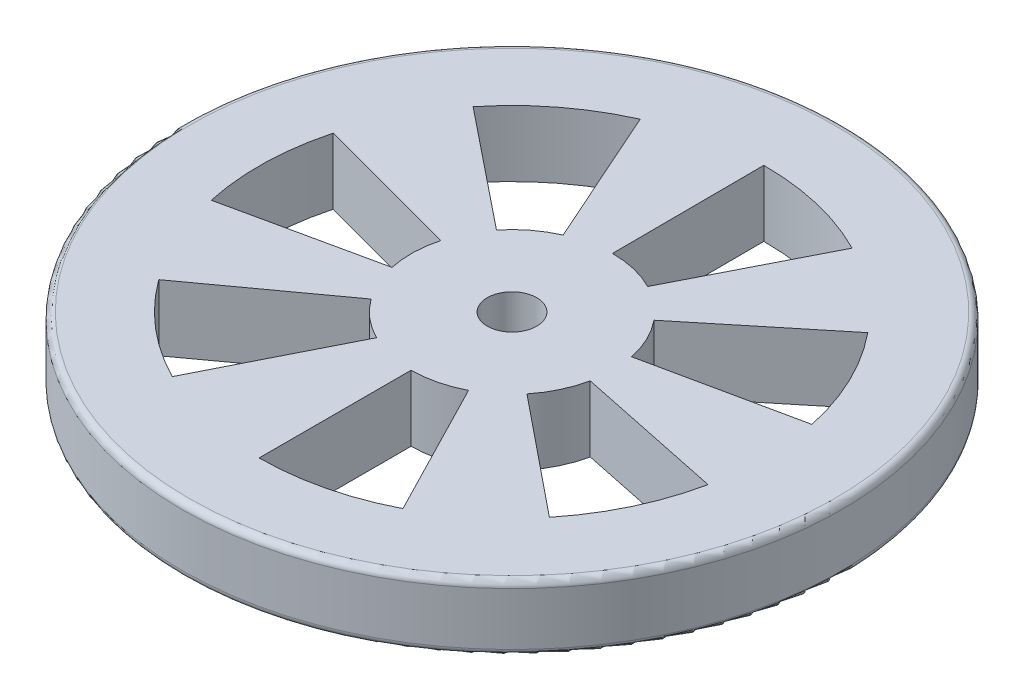
ISO-10303-21;
HEADER;
FILE_DESCRIPTION(('STEP AP214'),'2;1');
FILE_NAME('part.step','',(''),(''),'','','');
FILE_SCHEMA(('AUTOMOTIVE_DESIGN { 1 0 10303 214 1 1 1 1 }'));
ENDSEC;
DATA;
#1=APPLICATION_CONTEXT('core data for automotive mechanical design processes');
#2=APPLICATION_PROTOCOL_DEFINITION('international standard','automotive_design',2000,#1);
#3=PRODUCT_CONTEXT('',#1,'mechanical');
#4=PRODUCT('Part','Part','',(#3));
#5=PRODUCT_RELATED_PRODUCT_CATEGORY('part','',(#4));
#6=PRODUCT_DEFINITION_FORMATION('','',#4);
#7=PRODUCT_DEFINITION_CONTEXT('part definition',#1,'design');
#8=PRODUCT_DEFINITION('design','',#6,#7);
#9=PRODUCT_DEFINITION_SHAPE('','',#8);
#10=(LENGTH_UNIT() NAMED_UNIT(*) SI_UNIT(.MILLI.,.METRE.));
#11=(NAMED_UNIT(*) PLANE_ANGLE_UNIT() SI_UNIT($,.RADIAN.));
#12=(NAMED_UNIT(*) SI_UNIT($,.STERADIAN.) SOLID_ANGLE_UNIT());
#13=UNCERTAINTY_MEASURE_WITH_UNIT(LENGTH_MEASURE(1.E-05),#10,'distance_accuracy_value','');
#14=(GEOMETRIC_REPRESENTATION_CONTEXT(3) GLOBAL_UNCERTAINTY_ASSIGNED_CONTEXT((#13)) GLOBAL_UNIT_ASSIGNED_CONTEXT((#10,
#11,#12)) REPRESENTATION_CONTEXT('',''));
#15=CARTESIAN_POINT('',(0.,0.,0.));
#16=DIRECTION('',(0.,0.,1.));
#17=DIRECTION('',(1.,0.,0.));
#18=AXIS2_PLACEMENT_3D('',#15,#16,#17);
#19=CARTESIAN_POINT('',(0.,20.,0.));
#20=DIRECTION('',(0.,-1.,0.));
#21=DIRECTION('',(0.,0.,-1.));
#22=AXIS2_PLACEMENT_3D('',#19,#20,#21);
#23=CYLINDRICAL_SURFACE('',#22,100.);
#24=CARTESIAN_POINT('',(0.,2.,0.));
#25=DIRECTION('',(0.,1.,0.));
#26=DIRECTION('',(0.,0.,1.));
#27=AXIS2_PLACEMENT_3D('',#24,#25,#26);
#28=CIRCLE('',#27,100.);
#29=CARTESIAN_POINT('',(0.,2.,100.));
#30=VERTEX_POINT('',#29);
#31=EDGE_CURVE('E460',#30,#30,#28,.T.);
#32=ORIENTED_EDGE('',*,*,#31,.T.);
#33=EDGE_LOOP('',(#32));
#34=FACE_BOUND('',#33,.T.);
#35=CARTESIAN_POINT('',(0.,18.,0.));
#36=DIRECTION('',(0.,1.,0.));
#37=DIRECTION('',(0.,0.,1.));
#38=AXIS2_PLACEMENT_3D('',#35,#36,#37);
#39=CIRCLE('',#38,100.);
#40=CARTESIAN_POINT('',(0.,18.,100.));
#41=VERTEX_POINT('',#40);
#42=EDGE_CURVE('E455',#41,#41,#39,.F.);
#43=ORIENTED_EDGE('',*,*,#42,.T.);
#44=EDGE_LOOP('',(#43));
#45=FACE_BOUND('',#44,.T.);
#46=ADVANCED_FACE('F35',(#34,#45),#23,.T.);
#47=CARTESIAN_POINT('',(0.,20.,0.));
#48=DIRECTION('',(0.,1.,0.));
#49=DIRECTION('',(0.,0.,1.));
#50=AXIS2_PLACEMENT_3D('',#47,#48,#49);
#51=PLANE('',#50);
#52=CARTESIAN_POINT('',(0.,20.,0.));
#53=DIRECTION('',(0.,1.,0.));
#54=DIRECTION('',(0.80901699437494,0.,-0.587785252292483));
#55=AXIS2_PLACEMENT_3D('',#52,#53,#54);
#56=CIRCLE('',#55,30.617728898153);
#57=CARTESIAN_POINT('',(-24.7702630077705,20.,17.9966495050237));
#58=VERTEX_POINT('',#57);
#59=CARTESIAN_POINT('',(-13.7823703581596,20.,27.3402924306108));
#60=VERTEX_POINT('',#59);
#61=EDGE_CURVE('E359',#58,#60,#56,.T.);
#62=ORIENTED_EDGE('',*,*,#61,.T.);
#63=DIRECTION('',(-0.450143457864081,0.,0.892956251639557));
#64=VECTOR('',#63,1.);
#65=CARTESIAN_POINT('',(-13.7823703581596,20.,27.3402924306108));
#66=LINE('',#65,#64);
#67=CARTESIAN_POINT('',(-34.5404654667507,20.,68.5184334776853));
#68=VERTEX_POINT('',#67);
#69=EDGE_CURVE('E362',#60,#68,#66,.T.);
#70=ORIENTED_EDGE('',*,*,#69,.T.);
#71=CARTESIAN_POINT('',(0.,20.,0.));
#72=DIRECTION('',(0.,-1.,0.));
#73=DIRECTION('',(0.80901699437494,0.,-0.587785252292483));
#74=AXIS2_PLACEMENT_3D('',#71,#72,#73);
#75=CIRCLE('',#74,76.7321280878862);
#76=CARTESIAN_POINT('',(-62.0775956376546,20.,45.1020132670773));
#77=VERTEX_POINT('',#76);
#78=EDGE_CURVE('E50',#68,#77,#75,.T.);
#79=ORIENTED_EDGE('',*,*,#78,.T.);
#80=DIRECTION('',(0.80901699437494,0.,-0.587785252292483));
#81=VECTOR('',#80,1.);
#82=CARTESIAN_POINT('',(-24.7702630077705,20.,17.9966495050237));
#83=LINE('',#82,#81);
#84=EDGE_CURVE('E367',#77,#58,#83,.T.);
#85=ORIENTED_EDGE('',*,*,#84,.T.);
#86=EDGE_LOOP('',(#62,#70,#79,#85));
#87=FACE_BOUND('',#86,.T.);
#88=CARTESIAN_POINT('',(0.,20.,0.));
#89=DIRECTION('',(0.,1.,0.));
#90=DIRECTION('',(0.406736643075808,0.,0.913545457642598));
#91=AXIS2_PLACEMENT_3D('',#88,#89,#90);
#92=CIRCLE('',#91,30.617728898153);
#93=CARTESIAN_POINT('',(-12.4533522706399,20.,-27.9706871582401));
#94=VERTEX_POINT('',#93);
#95=CARTESIAN_POINT('',(-23.877325519721,20.,-19.1655589249589));
#96=VERTEX_POINT('',#95);
#97=EDGE_CURVE('E331',#94,#96,#92,.T.);
#98=ORIENTED_EDGE('',*,*,#97,.T.);
#99=DIRECTION('',(-0.779852927666409,0.,-0.625962787400442));
#100=VECTOR('',#99,1.);
#101=CARTESIAN_POINT('',(-23.877325519721,20.,-19.1655589249589));
#102=LINE('',#101,#100);
#103=CARTESIAN_POINT('',(-59.839774735412,20.,-48.031456781061));
#104=VERTEX_POINT('',#103);
#105=EDGE_CURVE('E334',#96,#104,#102,.T.);
#106=ORIENTED_EDGE('',*,*,#105,.T.);
#107=CARTESIAN_POINT('',(0.,20.,0.));
#108=DIRECTION('',(0.,-1.,0.));
#109=DIRECTION('',(0.406736643075808,0.,0.913545457642598));
#110=AXIS2_PLACEMENT_3D('',#107,#108,#109);
#111=CIRCLE('',#110,76.7321280878862);
#112=CARTESIAN_POINT('',(-31.2097681945297,20.,-70.0982870699384));
#113=VERTEX_POINT('',#112);
#114=EDGE_CURVE('E58',#104,#113,#111,.T.);
#115=ORIENTED_EDGE('',*,*,#114,.T.);
#116=DIRECTION('',(0.406736643075807,0.,0.913545457642598));
#117=VECTOR('',#116,1.);
#118=CARTESIAN_POINT('',(-12.4533522706399,20.,-27.9706871582401));
#119=LINE('',#118,#117);
#120=EDGE_CURVE('E339',#113,#94,#119,.T.);
#121=ORIENTED_EDGE('',*,*,#120,.T.);
#122=EDGE_LOOP('',(#98,#106,#115,#121));
#123=FACE_BOUND('',#122,.T.);
#124=CARTESIAN_POINT('',(0.,20.,0.));
#125=DIRECTION('',(0.,1.,0.));
#126=DIRECTION('',(0.965925826289071,0.,0.258819045102511));
#127=AXIS2_PLACEMENT_3D('',#124,#125,#126);
#128=CIRCLE('',#127,30.617728898153);
#129=CARTESIAN_POINT('',(-29.5744550850432,20.,-7.92445135662751));
#130=VERTEX_POINT('',#129);
#131=CARTESIAN_POINT('',(-29.9209245508925,20.,6.49489006070088));
#132=VERTEX_POINT('',#131);
#133=EDGE_CURVE('E297',#130,#132,#128,.T.);
#134=ORIENTED_EDGE('',*,*,#133,.T.);
#135=DIRECTION('',(-0.977241801650986,0.,0.212128407116855));
#136=VECTOR('',#135,1.);
#137=CARTESIAN_POINT('',(-29.9209245508925,20.,6.49489006070088));
#138=LINE('',#137,#136);
#139=CARTESIAN_POINT('',(-74.9858430971202,20.,16.2770641059698));
#140=VERTEX_POINT('',#139);
#141=EDGE_CURVE('E300',#132,#140,#138,.T.);
#142=ORIENTED_EDGE('',*,*,#141,.T.);
#143=CARTESIAN_POINT('',(0.,20.,0.));
#144=DIRECTION('',(0.,-1.,0.));
#145=DIRECTION('',(0.965925826289071,0.,0.258819045102511));
#146=AXIS2_PLACEMENT_3D('',#143,#144,#145);
#147=CIRCLE('',#146,76.7321280878862);
#148=CARTESIAN_POINT('',(-74.1175442262103,20.,-19.8597361203903));
#149=VERTEX_POINT('',#148);
#150=EDGE_CURVE('E304',#140,#149,#147,.T.);
#151=ORIENTED_EDGE('',*,*,#150,.T.);
#152=DIRECTION('',(0.965925826289071,0.,0.258819045102511));
#153=VECTOR('',#152,1.);
#154=CARTESIAN_POINT('',(-29.5744550850432,20.,-7.92445135662751));
#155=LINE('',#154,#153);
#156=EDGE_CURVE('E307',#149,#130,#155,.T.);
#157=ORIENTED_EDGE('',*,*,#156,.T.);
#158=EDGE_LOOP('',(#134,#142,#151,#157));
#159=FACE_BOUND('',#158,.T.);
#160=CARTESIAN_POINT('',(0.,20.,0.));
#161=DIRECTION('',(0.,1.,0.));
#162=DIRECTION('',(-0.978147600733805,0.,0.207911690817763));
#163=AXIS2_PLACEMENT_3D('',#160,#161,#162);
#164=CIRCLE('',#163,30.617728898153);
#165=CARTESIAN_POINT('',(29.9486580616464,20.,-6.36578378421487));
#166=VERTEX_POINT('',#165);
#167=CARTESIAN_POINT('',(23.7111206001822,20.,-19.3708049074995));
#168=VERTEX_POINT('',#167);
#169=EDGE_CURVE('E265',#166,#168,#164,.T.);
#170=ORIENTED_EDGE('',*,*,#169,.T.);
#171=DIRECTION('',(0.774424539424693,0.,-0.632666288604706));
#172=VECTOR('',#171,1.);
#173=CARTESIAN_POINT('',(23.7111206001822,20.,-19.3708049074995));
#174=LINE('',#173,#172);
#175=CARTESIAN_POINT('',(59.4232429535378,20.,-48.5458306941039));
#176=VERTEX_POINT('',#175);
#177=EDGE_CURVE('E268',#168,#176,#174,.T.);
#178=ORIENTED_EDGE('',*,*,#177,.T.);
#179=CARTESIAN_POINT('',(0.,20.,0.));
#180=DIRECTION('',(0.,-1.,0.));
#181=DIRECTION('',(-0.978147600733805,0.,0.207911690817763));
#182=AXIS2_PLACEMENT_3D('',#179,#180,#181);
#183=CIRCLE('',#182,76.7321280878862);
#184=CARTESIAN_POINT('',(75.0553469883649,20.,-15.9535064907976));
#185=VERTEX_POINT('',#184);
#186=EDGE_CURVE('E272',#176,#185,#183,.T.);
#187=ORIENTED_EDGE('',*,*,#186,.T.);
#188=DIRECTION('',(-0.978147600733805,0.,0.207911690817763));
#189=VECTOR('',#188,1.);
#190=CARTESIAN_POINT('',(29.9486580616464,20.,-6.36578378421487));
#191=LINE('',#190,#189);
#192=EDGE_CURVE('E275',#185,#166,#191,.T.);
#193=ORIENTED_EDGE('',*,*,#192,.T.);
#194=EDGE_LOOP('',(#170,#178,#187,#193));
#195=FACE_BOUND('',#194,.T.);
#196=CARTESIAN_POINT('',(0.,20.,0.));
#197=DIRECTION('',(0.,1.,0.));
#198=DIRECTION('',(-0.453990499739541,0.,0.891006524188371));
#199=AXIS2_PLACEMENT_3D('',#196,#197,#198);
#200=CIRCLE('',#199,30.617728898153);
#201=CARTESIAN_POINT('',(13.9001580433623,20.,-27.2805962040851));
#202=VERTEX_POINT('',#201);
#203=CARTESIAN_POINT('',(-0.132051115697628,20.,-30.6174441353885));
#204=VERTEX_POINT('',#203);
#205=EDGE_CURVE('E224',#202,#204,#200,.T.);
#206=ORIENTED_EDGE('',*,*,#205,.T.);
#207=DIRECTION('',(-0.00431289714978161,0.,-0.999990699415837));
#208=VECTOR('',#207,1.);
#209=CARTESIAN_POINT('',(-0.132051115697628,20.,-30.6174441353885));
#210=LINE('',#209,#208);
#211=CARTESIAN_POINT('',(-0.33093777652692,20.,-76.731414434271));
#212=VERTEX_POINT('',#211);
#213=EDGE_CURVE('E236',#204,#212,#210,.T.);
#214=ORIENTED_EDGE('',*,*,#213,.T.);
#215=CARTESIAN_POINT('',(0.,20.,0.));
#216=DIRECTION('',(0.,-1.,0.));
#217=DIRECTION('',(-0.453990499739541,0.,0.891006524188371));
#218=AXIS2_PLACEMENT_3D('',#215,#216,#217);
#219=CIRCLE('',#218,76.7321280878862);
#220=CARTESIAN_POINT('',(34.835657176698,20.,-68.3688267411643));
#221=VERTEX_POINT('',#220);
#222=EDGE_CURVE('E240',#212,#221,#219,.T.);
#223=ORIENTED_EDGE('',*,*,#222,.T.);
#224=DIRECTION('',(-0.453990499739541,0.,0.891006524188371));
#225=VECTOR('',#224,1.);
#226=CARTESIAN_POINT('',(13.9001580433623,20.,-27.2805962040851));
#227=LINE('',#226,#225);
#228=EDGE_CURVE('E232',#221,#202,#227,.T.);
#229=ORIENTED_EDGE('',*,*,#228,.T.);
#230=EDGE_LOOP('',(#206,#214,#223,#229));
#231=FACE_BOUND('',#230,.T.);
#232=CARTESIAN_POINT('',(0.,20.,0.));
#233=DIRECTION('',(0.,1.,0.));
#234=DIRECTION('',(-0.777145961456972,0.,-0.629320391049836));
#235=AXIS2_PLACEMENT_3D('',#232,#233,#234);
#236=CIRCLE('',#235,30.617728898153);
#237=CARTESIAN_POINT('',(23.794444362184,20.,19.2683611232435));
#238=VERTEX_POINT('',#237);
#239=CARTESIAN_POINT('',(29.9758344923706,20.,6.23655909671318));
#240=VERTEX_POINT('',#239);
#241=EDGE_CURVE('E388',#238,#240,#236,.T.);
#242=ORIENTED_EDGE('',*,*,#241,.T.);
#243=DIRECTION('',(0.979035205128455,0.,0.203691107118314));
#244=VECTOR('',#243,1.);
#245=CARTESIAN_POINT('',(29.9758344923706,20.,6.23655909671318));
#246=LINE('',#245,#244);
#247=CARTESIAN_POINT('',(75.1234547624665,20.,15.6296521217658));
#248=VERTEX_POINT('',#247);
#249=EDGE_CURVE('E391',#240,#248,#246,.T.);
#250=ORIENTED_EDGE('',*,*,#249,.T.);
#251=CARTESIAN_POINT('',(0.,20.,0.));
#252=DIRECTION('',(0.,-1.,0.));
#253=DIRECTION('',(-0.777145961456972,0.,-0.629320391049836));
#254=AXIS2_PLACEMENT_3D('',#251,#252,#253);
#255=CIRCLE('',#254,76.7321280878862);
#256=CARTESIAN_POINT('',(59.6320634574999,20.,48.2890928543546));
#257=VERTEX_POINT('',#256);
#258=EDGE_CURVE('E395',#248,#257,#255,.T.);
#259=ORIENTED_EDGE('',*,*,#258,.T.);
#260=DIRECTION('',(-0.777145961456972,0.,-0.629320391049836));
#261=VECTOR('',#260,1.);
#262=CARTESIAN_POINT('',(23.794444362184,20.,19.2683611232435));
#263=LINE('',#262,#261);
#264=EDGE_CURVE('E398',#257,#238,#263,.T.);
#265=ORIENTED_EDGE('',*,*,#264,.T.);
#266=EDGE_LOOP('',(#242,#250,#259,#265));
#267=FACE_BOUND('',#266,.T.);
#268=CARTESIAN_POINT('',(0.,20.,0.));
#269=DIRECTION('',(0.,1.,0.));
#270=DIRECTION('',(0.,0.,-1.));
#271=AXIS2_PLACEMENT_3D('',#268,#269,#270);
#272=CIRCLE('',#271,30.617728898153);
#273=CARTESIAN_POINT('',(0.,20.,30.617728898153));
#274=VERTEX_POINT('',#273);
#275=CARTESIAN_POINT('',(14.0176871693854,20.,27.2203925265974));
#276=VERTEX_POINT('',#275);
#277=EDGE_CURVE('E420',#274,#276,#272,.T.);
#278=ORIENTED_EDGE('',*,*,#277,.T.);
#279=DIRECTION('',(0.457829096861298,0.,0.889040222974848));
#280=VECTOR('',#279,1.);
#281=CARTESIAN_POINT('',(14.0176871693854,20.,27.2203925265974));
#282=LINE('',#281,#280);
#283=CARTESIAN_POINT('',(35.1302009027224,20.,68.217948264589));
#284=VERTEX_POINT('',#283);
#285=EDGE_CURVE('E423',#276,#284,#282,.T.);
#286=ORIENTED_EDGE('',*,*,#285,.T.);
#287=CARTESIAN_POINT('',(0.,20.,0.));
#288=DIRECTION('',(0.,-1.,0.));
#289=DIRECTION('',(0.,0.,-1.));
#290=AXIS2_PLACEMENT_3D('',#287,#288,#289);
#291=CIRCLE('',#290,76.7321280878862);
#292=CARTESIAN_POINT('',(0.,20.,76.7321280878862));
#293=VERTEX_POINT('',#292);
#294=EDGE_CURVE('E427',#284,#293,#291,.T.);
#295=ORIENTED_EDGE('',*,*,#294,.T.);
#296=DIRECTION('',(0.,0.,-1.));
#297=VECTOR('',#296,1.);
#298=CARTESIAN_POINT('',(0.,20.,30.617728898153));
#299=LINE('',#298,#297);
#300=EDGE_CURVE('E430',#293,#274,#299,.T.);
#301=ORIENTED_EDGE('',*,*,#300,.T.);
#302=EDGE_LOOP('',(#278,#286,#295,#301));
#303=FACE_BOUND('',#302,.T.);
#304=CARTESIAN_POINT('',(0.,20.,0.));
#305=DIRECTION('',(0.,1.,0.));
#306=DIRECTION('',(0.,0.,1.));
#307=AXIS2_PLACEMENT_3D('',#304,#305,#306);
#308=CIRCLE('',#307,7.5);
#309=CARTESIAN_POINT('',(0.,20.,7.5));
#310=VERTEX_POINT('',#309);
#311=EDGE_CURVE('E445',#310,#310,#308,.T.);
#312=ORIENTED_EDGE('',*,*,#311,.F.);
#313=EDGE_LOOP('',(#312));
#314=FACE_BOUND('',#313,.T.);
#315=CARTESIAN_POINT('',(0.,20.,0.));
#316=DIRECTION('',(0.,1.,0.));
#317=DIRECTION('',(0.,0.,1.));
#318=AXIS2_PLACEMENT_3D('',#315,#316,#317);
#319=CIRCLE('',#318,98.);
#320=CARTESIAN_POINT('',(0.,20.,98.));
#321=VERTEX_POINT('',#320);
#322=EDGE_CURVE('E11',#321,#321,#319,.T.);
#323=ORIENTED_EDGE('',*,*,#322,.T.);
#324=EDGE_LOOP('',(#323));
#325=FACE_BOUND('',#324,.T.);
#326=ADVANCED_FACE('F242',(#87,#123,#159,#195,#231,#267,#303,#314,#325),#51,.T.);
#327=CARTESIAN_POINT('',(0.,0.,0.));
#328=DIRECTION('',(0.,1.,0.));
#329=DIRECTION('',(0.,0.,1.));
#330=AXIS2_PLACEMENT_3D('',#327,#328,#329);
#331=PLANE('',#330);
#332=DIRECTION('',(-0.450143457864081,0.,0.892956251639557));
#333=VECTOR('',#332,1.);
#334=CARTESIAN_POINT('',(-13.7823703581596,0.,27.3402924306108));
#335=LINE('',#334,#333);
#336=CARTESIAN_POINT('',(-13.7823703581596,0.,27.3402924306108));
#337=VERTEX_POINT('',#336);
#338=CARTESIAN_POINT('',(-34.5404654667506,0.,68.5184334776853));
#339=VERTEX_POINT('',#338);
#340=EDGE_CURVE('E373',#337,#339,#335,.T.);
#341=ORIENTED_EDGE('',*,*,#340,.F.);
#342=CARTESIAN_POINT('',(0.,0.,0.));
#343=DIRECTION('',(0.,1.,0.));
#344=DIRECTION('',(0.80901699437494,0.,-0.587785252292483));
#345=AXIS2_PLACEMENT_3D('',#342,#343,#344);
#346=CIRCLE('',#345,30.617728898153);
#347=CARTESIAN_POINT('',(-24.7702630077705,0.,17.9966495050237));
#348=VERTEX_POINT('',#347);
#349=EDGE_CURVE('E371',#348,#337,#346,.T.);
#350=ORIENTED_EDGE('',*,*,#349,.F.);
#351=DIRECTION('',(0.80901699437494,0.,-0.587785252292483));
#352=VECTOR('',#351,1.);
#353=CARTESIAN_POINT('',(-24.7702630077705,0.,17.9966495050237));
#354=LINE('',#353,#352);
#355=CARTESIAN_POINT('',(-62.0775956376546,0.,45.1020132670773));
#356=VERTEX_POINT('',#355);
#357=EDGE_CURVE('E363',#356,#348,#354,.T.);
#358=ORIENTED_EDGE('',*,*,#357,.F.);
#359=CARTESIAN_POINT('',(0.,0.,0.));
#360=DIRECTION('',(0.,-1.,0.));
#361=DIRECTION('',(0.80901699437494,0.,-0.587785252292483));
#362=AXIS2_PLACEMENT_3D('',#359,#360,#361);
#363=CIRCLE('',#362,76.7321280878862);
#364=EDGE_CURVE('E376',#339,#356,#363,.T.);
#365=ORIENTED_EDGE('',*,*,#364,.F.);
#366=EDGE_LOOP('',(#341,#350,#358,#365));
#367=FACE_BOUND('',#366,.T.);
#368=DIRECTION('',(-0.779852927666409,0.,-0.625962787400442));
#369=VECTOR('',#368,1.);
#370=CARTESIAN_POINT('',(-23.877325519721,0.,-19.1655589249589));
#371=LINE('',#370,#369);
#372=CARTESIAN_POINT('',(-23.877325519721,0.,-19.1655589249589));
#373=VERTEX_POINT('',#372);
#374=CARTESIAN_POINT('',(-59.839774735412,0.,-48.031456781061));
#375=VERTEX_POINT('',#374);
#376=EDGE_CURVE('E344',#373,#375,#371,.T.);
#377=ORIENTED_EDGE('',*,*,#376,.F.);
#378=CARTESIAN_POINT('',(0.,0.,0.));
#379=DIRECTION('',(0.,1.,0.));
#380=DIRECTION('',(0.406736643075808,0.,0.913545457642598));
#381=AXIS2_PLACEMENT_3D('',#378,#379,#380);
#382=CIRCLE('',#381,30.617728898153);
#383=CARTESIAN_POINT('',(-12.4533522706399,0.,-27.9706871582401));
#384=VERTEX_POINT('',#383);
#385=EDGE_CURVE('E324',#384,#373,#382,.T.);
#386=ORIENTED_EDGE('',*,*,#385,.F.);
#387=DIRECTION('',(0.406736643075807,0.,0.913545457642598));
#388=VECTOR('',#387,1.);
#389=CARTESIAN_POINT('',(-12.4533522706399,0.,-27.9706871582401));
#390=LINE('',#389,#388);
#391=CARTESIAN_POINT('',(-31.2097681945297,0.,-70.0982870699384));
#392=VERTEX_POINT('',#391);
#393=EDGE_CURVE('E335',#392,#384,#390,.T.);
#394=ORIENTED_EDGE('',*,*,#393,.F.);
#395=CARTESIAN_POINT('',(0.,0.,0.));
#396=DIRECTION('',(0.,-1.,0.));
#397=DIRECTION('',(0.406736643075808,0.,0.913545457642598));
#398=AXIS2_PLACEMENT_3D('',#395,#396,#397);
#399=CIRCLE('',#398,76.7321280878862);
#400=EDGE_CURVE('E347',#375,#392,#399,.T.);
#401=ORIENTED_EDGE('',*,*,#400,.F.);
#402=EDGE_LOOP('',(#377,#386,#394,#401));
#403=FACE_BOUND('',#402,.T.);
#404=DIRECTION('',(-0.977241801650986,0.,0.212128407116855));
#405=VECTOR('',#404,1.);
#406=CARTESIAN_POINT('',(-29.9209245508925,0.,6.49489006070088));
#407=LINE('',#406,#405);
#408=CARTESIAN_POINT('',(-29.9209245508925,0.,6.49489006070088));
#409=VERTEX_POINT('',#408);
#410=CARTESIAN_POINT('',(-74.9858430971202,0.,16.2770641059698));
#411=VERTEX_POINT('',#410);
#412=EDGE_CURVE('E313',#409,#411,#407,.T.);
#413=ORIENTED_EDGE('',*,*,#412,.F.);
#414=CARTESIAN_POINT('',(0.,0.,0.));
#415=DIRECTION('',(0.,1.,0.));
#416=DIRECTION('',(0.965925826289071,0.,0.258819045102511));
#417=AXIS2_PLACEMENT_3D('',#414,#415,#416);
#418=CIRCLE('',#417,30.617728898153);
#419=CARTESIAN_POINT('',(-29.5744550850432,0.,-7.92445135662751));
#420=VERTEX_POINT('',#419);
#421=EDGE_CURVE('E311',#420,#409,#418,.T.);
#422=ORIENTED_EDGE('',*,*,#421,.F.);
#423=DIRECTION('',(0.965925826289071,0.,0.258819045102511));
#424=VECTOR('',#423,1.);
#425=CARTESIAN_POINT('',(-29.5744550850432,0.,-7.92445135662751));
#426=LINE('',#425,#424);
#427=CARTESIAN_POINT('',(-74.1175442262103,0.,-19.8597361203903));
#428=VERTEX_POINT('',#427);
#429=EDGE_CURVE('E301',#428,#420,#426,.T.);
#430=ORIENTED_EDGE('',*,*,#429,.F.);
#431=CARTESIAN_POINT('',(0.,0.,0.));
#432=DIRECTION('',(0.,-1.,0.));
#433=DIRECTION('',(0.965925826289071,0.,0.258819045102511));
#434=AXIS2_PLACEMENT_3D('',#431,#432,#433);
#435=CIRCLE('',#434,76.7321280878862);
#436=EDGE_CURVE('E317',#411,#428,#435,.T.);
#437=ORIENTED_EDGE('',*,*,#436,.F.);
#438=EDGE_LOOP('',(#413,#422,#430,#437));
#439=FACE_BOUND('',#438,.T.);
#440=DIRECTION('',(0.774424539424693,0.,-0.632666288604706));
#441=VECTOR('',#440,1.);
#442=CARTESIAN_POINT('',(23.7111206001822,0.,-19.3708049074995));
#443=LINE('',#442,#441);
#444=CARTESIAN_POINT('',(23.7111206001822,0.,-19.3708049074995));
#445=VERTEX_POINT('',#444);
#446=CARTESIAN_POINT('',(59.4232429535378,0.,-48.5458306941038));
#447=VERTEX_POINT('',#446);
#448=EDGE_CURVE('E280',#445,#447,#443,.T.);
#449=ORIENTED_EDGE('',*,*,#448,.F.);
#450=CARTESIAN_POINT('',(0.,0.,0.));
#451=DIRECTION('',(0.,1.,0.));
#452=DIRECTION('',(-0.978147600733805,0.,0.207911690817763));
#453=AXIS2_PLACEMENT_3D('',#450,#451,#452);
#454=CIRCLE('',#453,30.617728898153);
#455=CARTESIAN_POINT('',(29.9486580616464,0.,-6.36578378421487));
#456=VERTEX_POINT('',#455);
#457=EDGE_CURVE('E261',#456,#445,#454,.T.);
#458=ORIENTED_EDGE('',*,*,#457,.F.);
#459=DIRECTION('',(-0.978147600733805,0.,0.207911690817763));
#460=VECTOR('',#459,1.);
#461=CARTESIAN_POINT('',(29.9486580616464,0.,-6.36578378421487));
#462=LINE('',#461,#460);
#463=CARTESIAN_POINT('',(75.0553469883649,0.,-15.9535064907976));
#464=VERTEX_POINT('',#463);
#465=EDGE_CURVE('E269',#464,#456,#462,.T.);
#466=ORIENTED_EDGE('',*,*,#465,.F.);
#467=CARTESIAN_POINT('',(0.,0.,0.));
#468=DIRECTION('',(0.,-1.,0.));
#469=DIRECTION('',(-0.978147600733805,0.,0.207911690817763));
#470=AXIS2_PLACEMENT_3D('',#467,#468,#469);
#471=CIRCLE('',#470,76.7321280878862);
#472=EDGE_CURVE('E283',#447,#464,#471,.T.);
#473=ORIENTED_EDGE('',*,*,#472,.F.);
#474=EDGE_LOOP('',(#449,#458,#466,#473));
#475=FACE_BOUND('',#474,.T.);
#476=DIRECTION('',(-0.00431289714978161,0.,-0.999990699415837));
#477=VECTOR('',#476,1.);
#478=CARTESIAN_POINT('',(-0.132051115697628,0.,-30.6174441353885));
#479=LINE('',#478,#477);
#480=CARTESIAN_POINT('',(-0.132051115697628,0.,-30.6174441353885));
#481=VERTEX_POINT('',#480);
#482=CARTESIAN_POINT('',(-0.330937776526916,0.,-76.7314144342709));
#483=VERTEX_POINT('',#482);
#484=EDGE_CURVE('E254',#481,#483,#479,.T.);
#485=ORIENTED_EDGE('',*,*,#484,.F.);
#486=CARTESIAN_POINT('',(0.,0.,0.));
#487=DIRECTION('',(0.,1.,0.));
#488=DIRECTION('',(-0.453990499739541,0.,0.891006524188371));
#489=AXIS2_PLACEMENT_3D('',#486,#487,#488);
#490=CIRCLE('',#489,30.617728898153);
#491=CARTESIAN_POINT('',(13.9001580433623,0.,-27.2805962040851));
#492=VERTEX_POINT('',#491);
#493=EDGE_CURVE('E227',#492,#481,#490,.T.);
#494=ORIENTED_EDGE('',*,*,#493,.F.);
#495=DIRECTION('',(-0.453990499739541,0.,0.891006524188371));
#496=VECTOR('',#495,1.);
#497=CARTESIAN_POINT('',(13.9001580433623,0.,-27.2805962040851));
#498=LINE('',#497,#496);
#499=CARTESIAN_POINT('',(34.835657176698,0.,-68.3688267411643));
#500=VERTEX_POINT('',#499);
#501=EDGE_CURVE('E245',#500,#492,#498,.T.);
#502=ORIENTED_EDGE('',*,*,#501,.F.);
#503=CARTESIAN_POINT('',(0.,0.,0.));
#504=DIRECTION('',(0.,-1.,0.));
#505=DIRECTION('',(-0.453990499739541,0.,0.891006524188371));
#506=AXIS2_PLACEMENT_3D('',#503,#504,#505);
#507=CIRCLE('',#506,76.7321280878862);
#508=EDGE_CURVE('E248',#483,#500,#507,.T.);
#509=ORIENTED_EDGE('',*,*,#508,.F.);
#510=EDGE_LOOP('',(#485,#494,#502,#509));
#511=FACE_BOUND('',#510,.T.);
#512=DIRECTION('',(0.979035205128455,0.,0.203691107118314));
#513=VECTOR('',#512,1.);
#514=CARTESIAN_POINT('',(29.9758344923706,0.,6.23655909671318));
#515=LINE('',#514,#513);
#516=CARTESIAN_POINT('',(29.9758344923706,0.,6.23655909671318));
#517=VERTEX_POINT('',#516);
#518=CARTESIAN_POINT('',(75.1234547624665,0.,15.6296521217658));
#519=VERTEX_POINT('',#518);
#520=EDGE_CURVE('E403',#517,#519,#515,.T.);
#521=ORIENTED_EDGE('',*,*,#520,.F.);
#522=CARTESIAN_POINT('',(0.,0.,0.));
#523=DIRECTION('',(0.,1.,0.));
#524=DIRECTION('',(-0.777145961456972,0.,-0.629320391049836));
#525=AXIS2_PLACEMENT_3D('',#522,#523,#524);
#526=CIRCLE('',#525,30.617728898153);
#527=CARTESIAN_POINT('',(23.794444362184,0.,19.2683611232435));
#528=VERTEX_POINT('',#527);
#529=EDGE_CURVE('E290',#528,#517,#526,.T.);
#530=ORIENTED_EDGE('',*,*,#529,.F.);
#531=DIRECTION('',(-0.777145961456972,0.,-0.629320391049836));
#532=VECTOR('',#531,1.);
#533=CARTESIAN_POINT('',(23.794444362184,0.,19.2683611232435));
#534=LINE('',#533,#532);
#535=CARTESIAN_POINT('',(59.6320634574999,0.,48.2890928543546));
#536=VERTEX_POINT('',#535);
#537=EDGE_CURVE('E392',#536,#528,#534,.T.);
#538=ORIENTED_EDGE('',*,*,#537,.F.);
#539=CARTESIAN_POINT('',(0.,0.,0.));
#540=DIRECTION('',(0.,-1.,0.));
#541=DIRECTION('',(-0.777145961456972,0.,-0.629320391049836));
#542=AXIS2_PLACEMENT_3D('',#539,#540,#541);
#543=CIRCLE('',#542,76.7321280878862);
#544=EDGE_CURVE('E406',#519,#536,#543,.T.);
#545=ORIENTED_EDGE('',*,*,#544,.F.);
#546=EDGE_LOOP('',(#521,#530,#538,#545));
#547=FACE_BOUND('',#546,.T.);
#548=DIRECTION('',(0.457829096861298,0.,0.889040222974848));
#549=VECTOR('',#548,1.);
#550=CARTESIAN_POINT('',(14.0176871693854,0.,27.2203925265974));
#551=LINE('',#550,#549);
#552=CARTESIAN_POINT('',(14.0176871693854,0.,27.2203925265974));
#553=VERTEX_POINT('',#552);
#554=CARTESIAN_POINT('',(35.1302009027224,0.,68.217948264589));
#555=VERTEX_POINT('',#554);
#556=EDGE_CURVE('E435',#553,#555,#551,.T.);
#557=ORIENTED_EDGE('',*,*,#556,.F.);
#558=CARTESIAN_POINT('',(0.,0.,0.));
#559=DIRECTION('',(0.,1.,0.));
#560=DIRECTION('',(0.,0.,-1.));
#561=AXIS2_PLACEMENT_3D('',#558,#559,#560);
#562=CIRCLE('',#561,30.617728898153);
#563=CARTESIAN_POINT('',(0.,0.,30.617728898153));
#564=VERTEX_POINT('',#563);
#565=EDGE_CURVE('E413',#564,#553,#562,.T.);
#566=ORIENTED_EDGE('',*,*,#565,.F.);
#567=DIRECTION('',(0.,0.,-1.));
#568=VECTOR('',#567,1.);
#569=CARTESIAN_POINT('',(0.,0.,30.617728898153));
#570=LINE('',#569,#568);
#571=CARTESIAN_POINT('',(0.,0.,76.7321280878862));
#572=VERTEX_POINT('',#571);
#573=EDGE_CURVE('E424',#572,#564,#570,.T.);
#574=ORIENTED_EDGE('',*,*,#573,.F.);
#575=CARTESIAN_POINT('',(0.,0.,0.));
#576=DIRECTION('',(0.,-1.,0.));
#577=DIRECTION('',(0.,0.,-1.));
#578=AXIS2_PLACEMENT_3D('',#575,#576,#577);
#579=CIRCLE('',#578,76.7321280878862);
#580=EDGE_CURVE('E438',#555,#572,#579,.T.);
#581=ORIENTED_EDGE('',*,*,#580,.F.);
#582=EDGE_LOOP('',(#557,#566,#574,#581));
#583=FACE_BOUND('',#582,.T.);
#584=CARTESIAN_POINT('',(0.,0.,0.));
#585=DIRECTION('',(0.,1.,0.));
#586=DIRECTION('',(0.,0.,1.));
#587=AXIS2_PLACEMENT_3D('',#584,#585,#586);
#588=CIRCLE('',#587,7.5);
#589=CARTESIAN_POINT('',(0.,0.,7.5));
#590=VERTEX_POINT('',#589);
#591=EDGE_CURVE('E452',#590,#590,#588,.T.);
#592=ORIENTED_EDGE('',*,*,#591,.T.);
#593=EDGE_LOOP('',(#592));
#594=FACE_BOUND('',#593,.T.);
#595=CARTESIAN_POINT('',(0.,0.,0.));
#596=DIRECTION('',(0.,1.,0.));
#597=DIRECTION('',(0.,0.,1.));
#598=AXIS2_PLACEMENT_3D('',#595,#596,#597);
#599=CIRCLE('',#598,98.);
#600=CARTESIAN_POINT('',(0.,0.,98.));
#601=VERTEX_POINT('',#600);
#602=EDGE_CURVE('E43',#601,#601,#599,.F.);
#603=ORIENTED_EDGE('',*,*,#602,.T.);
#604=EDGE_LOOP('',(#603));
#605=FACE_BOUND('',#604,.T.);
#606=ADVANCED_FACE('F465',(#367,#403,#439,#475,#511,#547,#583,#594,#605),#331,.F.);
#607=CARTESIAN_POINT('',(0.,2.,0.));
#608=DIRECTION('',(0.,1.,0.));
#609=DIRECTION('',(0.,0.,1.));
#610=AXIS2_PLACEMENT_3D('',#607,#608,#609);
#611=TOROIDAL_SURFACE('',#610,98.,2.);
#612=ORIENTED_EDGE('',*,*,#602,.F.);
#613=EDGE_LOOP('',(#612));
#614=FACE_BOUND('',#613,.T.);
#615=ORIENTED_EDGE('',*,*,#31,.F.);
#616=EDGE_LOOP('',(#615));
#617=FACE_BOUND('',#616,.T.);
#618=ADVANCED_FACE('F467',(#614,#617),#611,.T.);
#619=CARTESIAN_POINT('',(0.,18.,0.));
#620=DIRECTION('',(0.,1.,0.));
#621=DIRECTION('',(0.,0.,1.));
#622=AXIS2_PLACEMENT_3D('',#619,#620,#621);
#623=TOROIDAL_SURFACE('',#622,98.,2.);
#624=ORIENTED_EDGE('',*,*,#42,.F.);
#625=EDGE_LOOP('',(#624));
#626=FACE_BOUND('',#625,.T.);
#627=ORIENTED_EDGE('',*,*,#322,.F.);
#628=EDGE_LOOP('',(#627));
#629=FACE_BOUND('',#628,.T.);
#630=ADVANCED_FACE('F37',(#626,#629),#623,.T.);
#631=CARTESIAN_POINT('',(0.,0.,0.));
#632=DIRECTION('',(0.,1.,0.));
#633=DIRECTION('',(0.,0.,1.));
#634=AXIS2_PLACEMENT_3D('',#631,#632,#633);
#635=CYLINDRICAL_SURFACE('',#634,7.5);
#636=ORIENTED_EDGE('',*,*,#591,.F.);
#637=EDGE_LOOP('',(#636));
#638=FACE_BOUND('',#637,.T.);
#639=ORIENTED_EDGE('',*,*,#311,.T.);
#640=EDGE_LOOP('',(#639));
#641=FACE_BOUND('',#640,.T.);
#642=ADVANCED_FACE('F479',(#638,#641),#635,.F.);
#643=CARTESIAN_POINT('',(0.,20.,0.));
#644=DIRECTION('',(0.,-1.,0.));
#645=DIRECTION('',(0.,0.,-1.));
#646=AXIS2_PLACEMENT_3D('',#643,#644,#645);
#647=CYLINDRICAL_SURFACE('',#646,30.617728898153);
#648=ORIENTED_EDGE('',*,*,#565,.T.);
#649=DIRECTION('',(0.,-1.,0.));
#650=VECTOR('',#649,1.);
#651=CARTESIAN_POINT('',(14.0176871693854,20.,27.2203925265974));
#652=LINE('',#651,#650);
#653=EDGE_CURVE('E433',#276,#553,#652,.T.);
#654=ORIENTED_EDGE('',*,*,#653,.F.);
#655=ORIENTED_EDGE('',*,*,#277,.F.);
#656=DIRECTION('',(0.,-1.,0.));
#657=VECTOR('',#656,1.);
#658=CARTESIAN_POINT('',(0.,20.,30.617728898153));
#659=LINE('',#658,#657);
#660=EDGE_CURVE('E443',#274,#564,#659,.T.);
#661=ORIENTED_EDGE('',*,*,#660,.T.);
#662=EDGE_LOOP('',(#648,#654,#655,#661));
#663=FACE_BOUND('',#662,.T.);
#664=ADVANCED_FACE('F494',(#663),#647,.T.);
#665=CARTESIAN_POINT('',(0.,20.,30.617728898153));
#666=DIRECTION('',(-1.,0.,0.));
#667=DIRECTION('',(0.,0.,1.));
#668=AXIS2_PLACEMENT_3D('',#665,#666,#667);
#669=PLANE('',#668);
#670=ORIENTED_EDGE('',*,*,#573,.T.);
#671=ORIENTED_EDGE('',*,*,#660,.F.);
#672=ORIENTED_EDGE('',*,*,#300,.F.);
#673=DIRECTION('',(0.,-1.,0.));
#674=VECTOR('',#673,1.);
#675=CARTESIAN_POINT('',(0.,20.,76.7321280878862));
#676=LINE('',#675,#674);
#677=EDGE_CURVE('E446',#293,#572,#676,.T.);
#678=ORIENTED_EDGE('',*,*,#677,.T.);
#679=EDGE_LOOP('',(#670,#671,#672,#678));
#680=FACE_BOUND('',#679,.T.);
#681=ADVANCED_FACE('F498',(#680),#669,.F.);
#682=CARTESIAN_POINT('',(0.,20.,0.));
#683=DIRECTION('',(0.,-1.,0.));
#684=DIRECTION('',(0.,0.,-1.));
#685=AXIS2_PLACEMENT_3D('',#682,#683,#684);
#686=CYLINDRICAL_SURFACE('',#685,76.7321280878862);
#687=ORIENTED_EDGE('',*,*,#580,.T.);
#688=ORIENTED_EDGE('',*,*,#677,.F.);
#689=ORIENTED_EDGE('',*,*,#294,.F.);
#690=DIRECTION('',(0.,-1.,0.));
#691=VECTOR('',#690,1.);
#692=CARTESIAN_POINT('',(35.1302009027224,20.,68.217948264589));
#693=LINE('',#692,#691);
#694=EDGE_CURVE('E448',#284,#555,#693,.T.);
#695=ORIENTED_EDGE('',*,*,#694,.T.);
#696=EDGE_LOOP('',(#687,#688,#689,#695));
#697=FACE_BOUND('',#696,.T.);
#698=ADVANCED_FACE('F504',(#697),#686,.F.);
#699=CARTESIAN_POINT('',(14.0176871693854,20.,27.2203925265974));
#700=DIRECTION('',(0.889040222974848,0.,-0.457829096861298));
#701=DIRECTION('',(-0.457829096861298,0.,-0.889040222974848));
#702=AXIS2_PLACEMENT_3D('',#699,#700,#701);
#703=PLANE('',#702);
#704=ORIENTED_EDGE('',*,*,#556,.T.);
#705=ORIENTED_EDGE('',*,*,#694,.F.);
#706=ORIENTED_EDGE('',*,*,#285,.F.);
#707=ORIENTED_EDGE('',*,*,#653,.T.);
#708=EDGE_LOOP('',(#704,#705,#706,#707));
#709=FACE_BOUND('',#708,.T.);
#710=ADVANCED_FACE('F500',(#709),#703,.F.);
#711=CARTESIAN_POINT('',(0.,20.,0.));
#712=DIRECTION('',(0.,-1.,0.));
#713=DIRECTION('',(0.,0.,-1.));
#714=AXIS2_PLACEMENT_3D('',#711,#712,#713);
#715=CYLINDRICAL_SURFACE('',#714,30.617728898153);
#716=ORIENTED_EDGE('',*,*,#529,.T.);
#717=DIRECTION('',(0.,-1.,0.));
#718=VECTOR('',#717,1.);
#719=CARTESIAN_POINT('',(29.9758344923706,20.,6.23655909671318));
#720=LINE('',#719,#718);
#721=EDGE_CURVE('E401',#240,#517,#720,.T.);
#722=ORIENTED_EDGE('',*,*,#721,.F.);
#723=ORIENTED_EDGE('',*,*,#241,.F.);
#724=DIRECTION('',(0.,-1.,0.));
#725=VECTOR('',#724,1.);
#726=CARTESIAN_POINT('',(23.794444362184,20.,19.2683611232435));
#727=LINE('',#726,#725);
#728=EDGE_CURVE('E411',#238,#528,#727,.T.);
#729=ORIENTED_EDGE('',*,*,#728,.T.);
#730=EDGE_LOOP('',(#716,#722,#723,#729));
#731=FACE_BOUND('',#730,.T.);
#732=ADVANCED_FACE('F503',(#731),#715,.T.);
#733=CARTESIAN_POINT('',(23.794444362184,20.,19.2683611232435));
#734=DIRECTION('',(-0.629320391049836,0.,0.777145961456972));
#735=DIRECTION('',(0.777145961456972,0.,0.629320391049836));
#736=AXIS2_PLACEMENT_3D('',#733,#734,#735);
#737=PLANE('',#736);
#738=ORIENTED_EDGE('',*,*,#537,.T.);
#739=ORIENTED_EDGE('',*,*,#728,.F.);
#740=ORIENTED_EDGE('',*,*,#264,.F.);
#741=DIRECTION('',(0.,-1.,0.));
#742=VECTOR('',#741,1.);
#743=CARTESIAN_POINT('',(59.6320634574999,20.,48.2890928543546));
#744=LINE('',#743,#742);
#745=EDGE_CURVE('E414',#257,#536,#744,.T.);
#746=ORIENTED_EDGE('',*,*,#745,.T.);
#747=EDGE_LOOP('',(#738,#739,#740,#746));
#748=FACE_BOUND('',#747,.T.);
#749=ADVANCED_FACE('F514',(#748),#737,.F.);
#750=CARTESIAN_POINT('',(0.,20.,0.));
#751=DIRECTION('',(0.,-1.,0.));
#752=DIRECTION('',(0.,0.,-1.));
#753=AXIS2_PLACEMENT_3D('',#750,#751,#752);
#754=CYLINDRICAL_SURFACE('',#753,76.7321280878862);
#755=ORIENTED_EDGE('',*,*,#544,.T.);
#756=ORIENTED_EDGE('',*,*,#745,.F.);
#757=ORIENTED_EDGE('',*,*,#258,.F.);
#758=DIRECTION('',(0.,-1.,0.));
#759=VECTOR('',#758,1.);
#760=CARTESIAN_POINT('',(75.1234547624665,20.,15.6296521217658));
#761=LINE('',#760,#759);
#762=EDGE_CURVE('E416',#248,#519,#761,.T.);
#763=ORIENTED_EDGE('',*,*,#762,.T.);
#764=EDGE_LOOP('',(#755,#756,#757,#763));
#765=FACE_BOUND('',#764,.T.);
#766=ADVANCED_FACE('F519',(#765),#754,.F.);
#767=CARTESIAN_POINT('',(29.9758344923706,20.,6.23655909671318));
#768=DIRECTION('',(0.203691107118314,0.,-0.979035205128455));
#769=DIRECTION('',(-0.979035205128455,0.,-0.203691107118314));
#770=AXIS2_PLACEMENT_3D('',#767,#768,#769);
#771=PLANE('',#770);
#772=ORIENTED_EDGE('',*,*,#520,.T.);
#773=ORIENTED_EDGE('',*,*,#762,.F.);
#774=ORIENTED_EDGE('',*,*,#249,.F.);
#775=ORIENTED_EDGE('',*,*,#721,.T.);
#776=EDGE_LOOP('',(#772,#773,#774,#775));
#777=FACE_BOUND('',#776,.T.);
#778=ADVANCED_FACE('F516',(#777),#771,.F.);
#779=CARTESIAN_POINT('',(0.,20.,0.));
#780=DIRECTION('',(0.,-1.,0.));
#781=DIRECTION('',(0.,0.,-1.));
#782=AXIS2_PLACEMENT_3D('',#779,#780,#781);
#783=CYLINDRICAL_SURFACE('',#782,30.617728898153);
#784=ORIENTED_EDGE('',*,*,#493,.T.);
#785=DIRECTION('',(0.,-1.,0.));
#786=VECTOR('',#785,1.);
#787=CARTESIAN_POINT('',(-0.132051115697628,20.,-30.6174441353885));
#788=LINE('',#787,#786);
#789=EDGE_CURVE('E220',#204,#481,#788,.T.);
#790=ORIENTED_EDGE('',*,*,#789,.F.);
#791=ORIENTED_EDGE('',*,*,#205,.F.);
#792=DIRECTION('',(0.,-1.,0.));
#793=VECTOR('',#792,1.);
#794=CARTESIAN_POINT('',(13.9001580433623,20.,-27.2805962040851));
#795=LINE('',#794,#793);
#796=EDGE_CURVE('E259',#202,#492,#795,.T.);
#797=ORIENTED_EDGE('',*,*,#796,.T.);
#798=EDGE_LOOP('',(#784,#790,#791,#797));
#799=FACE_BOUND('',#798,.T.);
#800=ADVANCED_FACE('F222',(#799),#783,.T.);
#801=CARTESIAN_POINT('',(13.9001580433623,20.,-27.2805962040851));
#802=DIRECTION('',(0.891006524188371,0.,0.453990499739541));
#803=DIRECTION('',(0.453990499739541,0.,-0.891006524188371));
#804=AXIS2_PLACEMENT_3D('',#801,#802,#803);
#805=PLANE('',#804);
#806=ORIENTED_EDGE('',*,*,#501,.T.);
#807=ORIENTED_EDGE('',*,*,#796,.F.);
#808=ORIENTED_EDGE('',*,*,#228,.F.);
#809=DIRECTION('',(0.,-1.,0.));
#810=VECTOR('',#809,1.);
#811=CARTESIAN_POINT('',(34.835657176698,20.,-68.3688267411643));
#812=LINE('',#811,#810);
#813=EDGE_CURVE('E262',#221,#500,#812,.T.);
#814=ORIENTED_EDGE('',*,*,#813,.T.);
#815=EDGE_LOOP('',(#806,#807,#808,#814));
#816=FACE_BOUND('',#815,.T.);
#817=ADVANCED_FACE('F591',(#816),#805,.F.);
#818=CARTESIAN_POINT('',(0.,20.,0.));
#819=DIRECTION('',(0.,-1.,0.));
#820=DIRECTION('',(0.,0.,-1.));
#821=AXIS2_PLACEMENT_3D('',#818,#819,#820);
#822=CYLINDRICAL_SURFACE('',#821,76.7321280878862);
#823=ORIENTED_EDGE('',*,*,#508,.T.);
#824=ORIENTED_EDGE('',*,*,#813,.F.);
#825=ORIENTED_EDGE('',*,*,#222,.F.);
#826=DIRECTION('',(0.,-1.,0.));
#827=VECTOR('',#826,1.);
#828=CARTESIAN_POINT('',(-0.330937776526916,20.,-76.7314144342709));
#829=LINE('',#828,#827);
#830=EDGE_CURVE('E231',#212,#483,#829,.T.);
#831=ORIENTED_EDGE('',*,*,#830,.T.);
#832=EDGE_LOOP('',(#823,#824,#825,#831));
#833=FACE_BOUND('',#832,.T.);
#834=ADVANCED_FACE('F594',(#833),#822,.F.);
#835=CARTESIAN_POINT('',(-0.132051115697628,20.,-30.6174441353885));
#836=DIRECTION('',(-0.999990699415837,0.,0.00431289714978161));
#837=DIRECTION('',(0.00431289714978161,0.,0.999990699415837));
#838=AXIS2_PLACEMENT_3D('',#835,#836,#837);
#839=PLANE('',#838);
#840=ORIENTED_EDGE('',*,*,#484,.T.);
#841=ORIENTED_EDGE('',*,*,#830,.F.);
#842=ORIENTED_EDGE('',*,*,#213,.F.);
#843=ORIENTED_EDGE('',*,*,#789,.T.);
#844=EDGE_LOOP('',(#840,#841,#842,#843));
#845=FACE_BOUND('',#844,.T.);
#846=ADVANCED_FACE('F237',(#845),#839,.F.);
#847=CARTESIAN_POINT('',(0.,20.,0.));
#848=DIRECTION('',(0.,-1.,0.));
#849=DIRECTION('',(0.,0.,-1.));
#850=AXIS2_PLACEMENT_3D('',#847,#848,#849);
#851=CYLINDRICAL_SURFACE('',#850,30.617728898153);
#852=ORIENTED_EDGE('',*,*,#457,.T.);
#853=DIRECTION('',(0.,-1.,0.));
#854=VECTOR('',#853,1.);
#855=CARTESIAN_POINT('',(23.7111206001822,20.,-19.3708049074995));
#856=LINE('',#855,#854);
#857=EDGE_CURVE('E278',#168,#445,#856,.T.);
#858=ORIENTED_EDGE('',*,*,#857,.F.);
#859=ORIENTED_EDGE('',*,*,#169,.F.);
#860=DIRECTION('',(0.,-1.,0.));
#861=VECTOR('',#860,1.);
#862=CARTESIAN_POINT('',(29.9486580616464,20.,-6.36578378421487));
#863=LINE('',#862,#861);
#864=EDGE_CURVE('E288',#166,#456,#863,.T.);
#865=ORIENTED_EDGE('',*,*,#864,.T.);
#866=EDGE_LOOP('',(#852,#858,#859,#865));
#867=FACE_BOUND('',#866,.T.);
#868=ADVANCED_FACE('F574',(#867),#851,.T.);
#869=CARTESIAN_POINT('',(29.9486580616464,20.,-6.36578378421487));
#870=DIRECTION('',(0.207911690817763,0.,0.978147600733805));
#871=DIRECTION('',(0.978147600733805,0.,-0.207911690817763));
#872=AXIS2_PLACEMENT_3D('',#869,#870,#871);
#873=PLANE('',#872);
#874=ORIENTED_EDGE('',*,*,#465,.T.);
#875=ORIENTED_EDGE('',*,*,#864,.F.);
#876=ORIENTED_EDGE('',*,*,#192,.F.);
#877=DIRECTION('',(0.,-1.,0.));
#878=VECTOR('',#877,1.);
#879=CARTESIAN_POINT('',(75.0553469883649,20.,-15.9535064907976));
#880=LINE('',#879,#878);
#881=EDGE_CURVE('E291',#185,#464,#880,.T.);
#882=ORIENTED_EDGE('',*,*,#881,.T.);
#883=EDGE_LOOP('',(#874,#875,#876,#882));
#884=FACE_BOUND('',#883,.T.);
#885=ADVANCED_FACE('F577',(#884),#873,.F.);
#886=CARTESIAN_POINT('',(0.,20.,0.));
#887=DIRECTION('',(0.,-1.,0.));
#888=DIRECTION('',(0.,0.,-1.));
#889=AXIS2_PLACEMENT_3D('',#886,#887,#888);
#890=CYLINDRICAL_SURFACE('',#889,76.7321280878862);
#891=ORIENTED_EDGE('',*,*,#472,.T.);
#892=ORIENTED_EDGE('',*,*,#881,.F.);
#893=ORIENTED_EDGE('',*,*,#186,.F.);
#894=DIRECTION('',(0.,-1.,0.));
#895=VECTOR('',#894,1.);
#896=CARTESIAN_POINT('',(59.4232429535378,20.,-48.5458306941038));
#897=LINE('',#896,#895);
#898=EDGE_CURVE('E293',#176,#447,#897,.T.);
#899=ORIENTED_EDGE('',*,*,#898,.T.);
#900=EDGE_LOOP('',(#891,#892,#893,#899));
#901=FACE_BOUND('',#900,.T.);
#902=ADVANCED_FACE('F581',(#901),#890,.F.);
#903=CARTESIAN_POINT('',(23.7111206001822,20.,-19.3708049074995));
#904=DIRECTION('',(-0.632666288604706,0.,-0.774424539424693));
#905=DIRECTION('',(-0.774424539424693,0.,0.632666288604706));
#906=AXIS2_PLACEMENT_3D('',#903,#904,#905);
#907=PLANE('',#906);
#908=ORIENTED_EDGE('',*,*,#448,.T.);
#909=ORIENTED_EDGE('',*,*,#898,.F.);
#910=ORIENTED_EDGE('',*,*,#177,.F.);
#911=ORIENTED_EDGE('',*,*,#857,.T.);
#912=EDGE_LOOP('',(#908,#909,#910,#911));
#913=FACE_BOUND('',#912,.T.);
#914=ADVANCED_FACE('F562',(#913),#907,.F.);
#915=CARTESIAN_POINT('',(0.,20.,0.));
#916=DIRECTION('',(0.,-1.,0.));
#917=DIRECTION('',(0.,0.,-1.));
#918=AXIS2_PLACEMENT_3D('',#915,#916,#917);
#919=CYLINDRICAL_SURFACE('',#918,30.617728898153);
#920=ORIENTED_EDGE('',*,*,#421,.T.);
#921=DIRECTION('',(0.,-1.,0.));
#922=VECTOR('',#921,1.);
#923=CARTESIAN_POINT('',(-29.9209245508925,20.,6.49489006070088));
#924=LINE('',#923,#922);
#925=EDGE_CURVE('E310',#132,#409,#924,.T.);
#926=ORIENTED_EDGE('',*,*,#925,.F.);
#927=ORIENTED_EDGE('',*,*,#133,.F.);
#928=DIRECTION('',(0.,-1.,0.));
#929=VECTOR('',#928,1.);
#930=CARTESIAN_POINT('',(-29.5744550850432,20.,-7.92445135662751));
#931=LINE('',#930,#929);
#932=EDGE_CURVE('E322',#130,#420,#931,.T.);
#933=ORIENTED_EDGE('',*,*,#932,.T.);
#934=EDGE_LOOP('',(#920,#926,#927,#933));
#935=FACE_BOUND('',#934,.T.);
#936=ADVANCED_FACE('F558',(#935),#919,.T.);
#937=CARTESIAN_POINT('',(-29.5744550850432,20.,-7.92445135662751));
#938=DIRECTION('',(0.258819045102511,0.,-0.965925826289071));
#939=DIRECTION('',(-0.965925826289071,0.,-0.258819045102511));
#940=AXIS2_PLACEMENT_3D('',#937,#938,#939);
#941=PLANE('',#940);
#942=ORIENTED_EDGE('',*,*,#429,.T.);
#943=ORIENTED_EDGE('',*,*,#932,.F.);
#944=ORIENTED_EDGE('',*,*,#156,.F.);
#945=DIRECTION('',(0.,-1.,0.));
#946=VECTOR('',#945,1.);
#947=CARTESIAN_POINT('',(-74.1175442262103,20.,-19.8597361203903));
#948=LINE('',#947,#946);
#949=EDGE_CURVE('E325',#149,#428,#948,.T.);
#950=ORIENTED_EDGE('',*,*,#949,.T.);
#951=EDGE_LOOP('',(#942,#943,#944,#950));
#952=FACE_BOUND('',#951,.T.);
#953=ADVANCED_FACE('F561',(#952),#941,.F.);
#954=CARTESIAN_POINT('',(0.,20.,0.));
#955=DIRECTION('',(0.,-1.,0.));
#956=DIRECTION('',(0.,0.,-1.));
#957=AXIS2_PLACEMENT_3D('',#954,#955,#956);
#958=CYLINDRICAL_SURFACE('',#957,76.7321280878862);
#959=ORIENTED_EDGE('',*,*,#436,.T.);
#960=ORIENTED_EDGE('',*,*,#949,.F.);
#961=ORIENTED_EDGE('',*,*,#150,.F.);
#962=DIRECTION('',(0.,-1.,0.));
#963=VECTOR('',#962,1.);
#964=CARTESIAN_POINT('',(-74.9858430971202,20.,16.2770641059698));
#965=LINE('',#964,#963);
#966=EDGE_CURVE('E327',#140,#411,#965,.T.);
#967=ORIENTED_EDGE('',*,*,#966,.T.);
#968=EDGE_LOOP('',(#959,#960,#961,#967));
#969=FACE_BOUND('',#968,.T.);
#970=ADVANCED_FACE('F566',(#969),#958,.F.);
#971=CARTESIAN_POINT('',(-29.9209245508925,20.,6.49489006070088));
#972=DIRECTION('',(0.212128407116855,0.,0.977241801650986));
#973=DIRECTION('',(0.977241801650987,0.,-0.212128407116855));
#974=AXIS2_PLACEMENT_3D('',#971,#972,#973);
#975=PLANE('',#974);
#976=ORIENTED_EDGE('',*,*,#412,.T.);
#977=ORIENTED_EDGE('',*,*,#966,.F.);
#978=ORIENTED_EDGE('',*,*,#141,.F.);
#979=ORIENTED_EDGE('',*,*,#925,.T.);
#980=EDGE_LOOP('',(#976,#977,#978,#979));
#981=FACE_BOUND('',#980,.T.);
#982=ADVANCED_FACE('F547',(#981),#975,.F.);
#983=CARTESIAN_POINT('',(0.,20.,0.));
#984=DIRECTION('',(0.,-1.,0.));
#985=DIRECTION('',(0.,0.,-1.));
#986=AXIS2_PLACEMENT_3D('',#983,#984,#985);
#987=CYLINDRICAL_SURFACE('',#986,30.617728898153);
#988=ORIENTED_EDGE('',*,*,#385,.T.);
#989=DIRECTION('',(0.,-1.,0.));
#990=VECTOR('',#989,1.);
#991=CARTESIAN_POINT('',(-23.877325519721,20.,-19.1655589249589));
#992=LINE('',#991,#990);
#993=EDGE_CURVE('E342',#96,#373,#992,.T.);
#994=ORIENTED_EDGE('',*,*,#993,.F.);
#995=ORIENTED_EDGE('',*,*,#97,.F.);
#996=DIRECTION('',(0.,-1.,0.));
#997=VECTOR('',#996,1.);
#998=CARTESIAN_POINT('',(-12.4533522706399,20.,-27.9706871582401));
#999=LINE('',#998,#997);
#1000=EDGE_CURVE('E255',#94,#384,#999,.T.);
#1001=ORIENTED_EDGE('',*,*,#1000,.T.);
#1002=EDGE_LOOP('',(#988,#994,#995,#1001));
#1003=FACE_BOUND('',#1002,.T.);
#1004=ADVANCED_FACE('F543',(#1003),#987,.T.);
#1005=CARTESIAN_POINT('',(-12.4533522706399,20.,-27.9706871582401));
#1006=DIRECTION('',(0.913545457642598,0.,-0.406736643075808));
#1007=DIRECTION('',(-0.406736643075808,0.,-0.913545457642598));
#1008=AXIS2_PLACEMENT_3D('',#1005,#1006,#1007);
#1009=PLANE('',#1008);
#1010=ORIENTED_EDGE('',*,*,#393,.T.);
#1011=ORIENTED_EDGE('',*,*,#1000,.F.);
#1012=ORIENTED_EDGE('',*,*,#120,.F.);
#1013=DIRECTION('',(0.,-1.,0.));
#1014=VECTOR('',#1013,1.);
#1015=CARTESIAN_POINT('',(-31.2097681945297,20.,-70.0982870699384));
#1016=LINE('',#1015,#1014);
#1017=EDGE_CURVE('E353',#113,#392,#1016,.T.);
#1018=ORIENTED_EDGE('',*,*,#1017,.T.);
#1019=EDGE_LOOP('',(#1010,#1011,#1012,#1018));
#1020=FACE_BOUND('',#1019,.T.);
#1021=ADVANCED_FACE('F546',(#1020),#1009,.F.);
#1022=CARTESIAN_POINT('',(0.,20.,0.));
#1023=DIRECTION('',(0.,-1.,0.));
#1024=DIRECTION('',(0.,0.,-1.));
#1025=AXIS2_PLACEMENT_3D('',#1022,#1023,#1024);
#1026=CYLINDRICAL_SURFACE('',#1025,76.7321280878862);
#1027=ORIENTED_EDGE('',*,*,#400,.T.);
#1028=ORIENTED_EDGE('',*,*,#1017,.F.);
#1029=ORIENTED_EDGE('',*,*,#114,.F.);
#1030=DIRECTION('',(0.,-1.,0.));
#1031=VECTOR('',#1030,1.);
#1032=CARTESIAN_POINT('',(-59.839774735412,20.,-48.031456781061));
#1033=LINE('',#1032,#1031);
#1034=EDGE_CURVE('E355',#104,#375,#1033,.T.);
#1035=ORIENTED_EDGE('',*,*,#1034,.T.);
#1036=EDGE_LOOP('',(#1027,#1028,#1029,#1035));
#1037=FACE_BOUND('',#1036,.T.);
#1038=ADVANCED_FACE('F551',(#1037),#1026,.F.);
#1039=CARTESIAN_POINT('',(-23.877325519721,20.,-19.1655589249589));
#1040=DIRECTION('',(-0.625962787400442,0.,0.779852927666409));
#1041=DIRECTION('',(0.779852927666409,0.,0.625962787400442));
#1042=AXIS2_PLACEMENT_3D('',#1039,#1040,#1041);
#1043=PLANE('',#1042);
#1044=ORIENTED_EDGE('',*,*,#376,.T.);
#1045=ORIENTED_EDGE('',*,*,#1034,.F.);
#1046=ORIENTED_EDGE('',*,*,#105,.F.);
#1047=ORIENTED_EDGE('',*,*,#993,.T.);
#1048=EDGE_LOOP('',(#1044,#1045,#1046,#1047));
#1049=FACE_BOUND('',#1048,.T.);
#1050=ADVANCED_FACE('F531',(#1049),#1043,.F.);
#1051=CARTESIAN_POINT('',(0.,20.,0.));
#1052=DIRECTION('',(0.,-1.,0.));
#1053=DIRECTION('',(0.,0.,-1.));
#1054=AXIS2_PLACEMENT_3D('',#1051,#1052,#1053);
#1055=CYLINDRICAL_SURFACE('',#1054,30.617728898153);
#1056=ORIENTED_EDGE('',*,*,#349,.T.);
#1057=DIRECTION('',(0.,-1.,0.));
#1058=VECTOR('',#1057,1.);
#1059=CARTESIAN_POINT('',(-13.7823703581596,20.,27.3402924306108));
#1060=LINE('',#1059,#1058);
#1061=EDGE_CURVE('E370',#60,#337,#1060,.T.);
#1062=ORIENTED_EDGE('',*,*,#1061,.F.);
#1063=ORIENTED_EDGE('',*,*,#61,.F.);
#1064=DIRECTION('',(0.,-1.,0.));
#1065=VECTOR('',#1064,1.);
#1066=CARTESIAN_POINT('',(-24.7702630077705,20.,17.9966495050237));
#1067=LINE('',#1066,#1065);
#1068=EDGE_CURVE('E314',#58,#348,#1067,.T.);
#1069=ORIENTED_EDGE('',*,*,#1068,.T.);
#1070=EDGE_LOOP('',(#1056,#1062,#1063,#1069));
#1071=FACE_BOUND('',#1070,.T.);
#1072=ADVANCED_FACE('F527',(#1071),#1055,.T.);
#1073=CARTESIAN_POINT('',(-24.7702630077705,20.,17.9966495050237));
#1074=DIRECTION('',(-0.587785252292483,0.,-0.80901699437494));
#1075=DIRECTION('',(-0.80901699437494,0.,0.587785252292483));
#1076=AXIS2_PLACEMENT_3D('',#1073,#1074,#1075);
#1077=PLANE('',#1076);
#1078=ORIENTED_EDGE('',*,*,#357,.T.);
#1079=ORIENTED_EDGE('',*,*,#1068,.F.);
#1080=ORIENTED_EDGE('',*,*,#84,.F.);
#1081=DIRECTION('',(0.,-1.,0.));
#1082=VECTOR('',#1081,1.);
#1083=CARTESIAN_POINT('',(-62.0775956376546,20.,45.1020132670773));
#1084=LINE('',#1083,#1082);
#1085=EDGE_CURVE('E382',#77,#356,#1084,.T.);
#1086=ORIENTED_EDGE('',*,*,#1085,.T.);
#1087=EDGE_LOOP('',(#1078,#1079,#1080,#1086));
#1088=FACE_BOUND('',#1087,.T.);
#1089=ADVANCED_FACE('F530',(#1088),#1077,.F.);
#1090=CARTESIAN_POINT('',(0.,20.,0.));
#1091=DIRECTION('',(0.,-1.,0.));
#1092=DIRECTION('',(0.,0.,-1.));
#1093=AXIS2_PLACEMENT_3D('',#1090,#1091,#1092);
#1094=CYLINDRICAL_SURFACE('',#1093,76.7321280878862);
#1095=ORIENTED_EDGE('',*,*,#364,.T.);
#1096=ORIENTED_EDGE('',*,*,#1085,.F.);
#1097=ORIENTED_EDGE('',*,*,#78,.F.);
#1098=DIRECTION('',(0.,-1.,0.));
#1099=VECTOR('',#1098,1.);
#1100=CARTESIAN_POINT('',(-34.5404654667506,20.,68.5184334776853));
#1101=LINE('',#1100,#1099);
#1102=EDGE_CURVE('E384',#68,#339,#1101,.T.);
#1103=ORIENTED_EDGE('',*,*,#1102,.T.);
#1104=EDGE_LOOP('',(#1095,#1096,#1097,#1103));
#1105=FACE_BOUND('',#1104,.T.);
#1106=ADVANCED_FACE('F536',(#1105),#1094,.F.);
#1107=CARTESIAN_POINT('',(-13.7823703581596,20.,27.3402924306108));
#1108=DIRECTION('',(0.892956251639557,0.,0.450143457864081));
#1109=DIRECTION('',(0.450143457864081,0.,-0.892956251639558));
#1110=AXIS2_PLACEMENT_3D('',#1107,#1108,#1109);
#1111=PLANE('',#1110);
#1112=ORIENTED_EDGE('',*,*,#340,.T.);
#1113=ORIENTED_EDGE('',*,*,#1102,.F.);
#1114=ORIENTED_EDGE('',*,*,#69,.F.);
#1115=ORIENTED_EDGE('',*,*,#1061,.T.);
#1116=EDGE_LOOP('',(#1112,#1113,#1114,#1115));
#1117=FACE_BOUND('',#1116,.T.);
#1118=ADVANCED_FACE('F533',(#1117),#1111,.F.);
#1119=CLOSED_SHELL('',(#46,#326,#606,#618,#630,#642,#664,#681,#698,#710,#732,#749,#766,#778,
#800,#817,#834,#846,#868,#885,#902,#914,#936,#953,#970,#982,#1004,#1021,#1038,#1050,#1072,#1089,
#1106,#1118));
#1120=MANIFOLD_SOLID_BREP('B2',#1119);
#1121=ADVANCED_BREP_SHAPE_REPRESENTATION('',(#18,#1120),#14);
#1122=SHAPE_DEFINITION_REPRESENTATION(#9,#1121);
ENDSEC;
END-ISO-10303-21;
